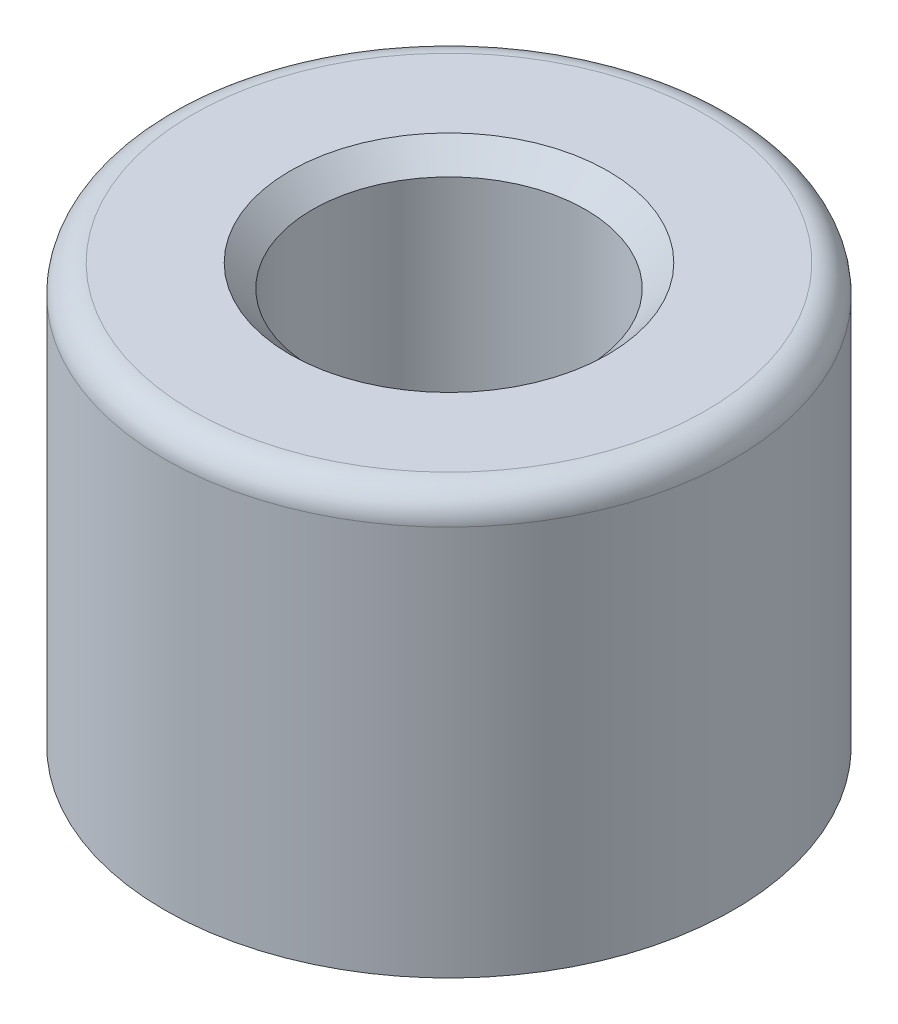
ISO-10303-21;
HEADER;
FILE_DESCRIPTION(('STEP AP214'),'2;1');
FILE_NAME('part.step','',(''),(''),'','','');
FILE_SCHEMA(('AUTOMOTIVE_DESIGN { 1 0 10303 214 1 1 1 1 }'));
ENDSEC;
DATA;
#1=APPLICATION_CONTEXT('core data for automotive mechanical design processes');
#2=APPLICATION_PROTOCOL_DEFINITION('international standard','automotive_design',2000,#1);
#3=PRODUCT_CONTEXT('',#1,'mechanical');
#4=PRODUCT('Part','Part','',(#3));
#5=PRODUCT_RELATED_PRODUCT_CATEGORY('part','',(#4));
#6=PRODUCT_DEFINITION_FORMATION('','',#4);
#7=PRODUCT_DEFINITION_CONTEXT('part definition',#1,'design');
#8=PRODUCT_DEFINITION('design','',#6,#7);
#9=PRODUCT_DEFINITION_SHAPE('','',#8);
#10=(LENGTH_UNIT() NAMED_UNIT(*) SI_UNIT(.MILLI.,.METRE.));
#11=(NAMED_UNIT(*) PLANE_ANGLE_UNIT() SI_UNIT($,.RADIAN.));
#12=(NAMED_UNIT(*) SI_UNIT($,.STERADIAN.) SOLID_ANGLE_UNIT());
#13=UNCERTAINTY_MEASURE_WITH_UNIT(LENGTH_MEASURE(1.E-05),#10,'distance_accuracy_value','');
#14=(GEOMETRIC_REPRESENTATION_CONTEXT(3) GLOBAL_UNCERTAINTY_ASSIGNED_CONTEXT((#13)) GLOBAL_UNIT_ASSIGNED_CONTEXT((#10,
#11,#12)) REPRESENTATION_CONTEXT('',''));
#15=CARTESIAN_POINT('',(0.,0.,0.));
#16=DIRECTION('',(0.,0.,1.));
#17=DIRECTION('',(1.,0.,0.));
#18=AXIS2_PLACEMENT_3D('',#15,#16,#17);
#19=CARTESIAN_POINT('',(0.,9.525,0.));
#20=DIRECTION('',(0.,-1.,0.));
#21=DIRECTION('',(0.,0.,-1.));
#22=AXIS2_PLACEMENT_3D('',#19,#20,#21);
#23=CYLINDRICAL_SURFACE('',#22,6.477);
#24=CARTESIAN_POINT('',(0.,8.89,0.));
#25=DIRECTION('',(0.,1.,0.));
#26=DIRECTION('',(0.,0.,1.));
#27=AXIS2_PLACEMENT_3D('',#24,#25,#26);
#28=CIRCLE('',#27,6.477);
#29=CARTESIAN_POINT('',(0.,8.89,6.477));
#30=VERTEX_POINT('',#29);
#31=EDGE_CURVE('E47',#30,#30,#28,.F.);
#32=ORIENTED_EDGE('',*,*,#31,.T.);
#33=EDGE_LOOP('',(#32));
#34=FACE_BOUND('',#33,.T.);
#35=CARTESIAN_POINT('',(0.,0.,0.));
#36=DIRECTION('',(0.,1.,0.));
#37=DIRECTION('',(0.,0.,1.));
#38=AXIS2_PLACEMENT_3D('',#35,#36,#37);
#39=CIRCLE('',#38,6.477);
#40=CARTESIAN_POINT('',(0.,0.,6.477));
#41=VERTEX_POINT('',#40);
#42=EDGE_CURVE('E56',#41,#41,#39,.T.);
#43=ORIENTED_EDGE('',*,*,#42,.T.);
#44=EDGE_LOOP('',(#43));
#45=FACE_BOUND('',#44,.T.);
#46=ADVANCED_FACE('F35',(#34,#45),#23,.T.);
#47=CARTESIAN_POINT('',(0.,9.525,0.));
#48=DIRECTION('',(0.,1.,0.));
#49=DIRECTION('',(0.,0.,1.));
#50=AXIS2_PLACEMENT_3D('',#47,#48,#49);
#51=PLANE('',#50);
#52=CARTESIAN_POINT('',(0.,9.525,0.));
#53=DIRECTION('',(0.,1.,0.));
#54=DIRECTION('',(0.,0.,1.));
#55=AXIS2_PLACEMENT_3D('',#52,#53,#54);
#56=CIRCLE('',#55,3.6195);
#57=CARTESIAN_POINT('',(0.,9.525,3.6195));
#58=VERTEX_POINT('',#57);
#59=EDGE_CURVE('E10',#58,#58,#56,.F.);
#60=ORIENTED_EDGE('',*,*,#59,.T.);
#61=EDGE_LOOP('',(#60));
#62=FACE_BOUND('',#61,.T.);
#63=CARTESIAN_POINT('',(0.,9.525,0.));
#64=DIRECTION('',(0.,1.,0.));
#65=DIRECTION('',(0.,0.,1.));
#66=AXIS2_PLACEMENT_3D('',#63,#64,#65);
#67=CIRCLE('',#66,5.842);
#68=CARTESIAN_POINT('',(0.,9.525,5.842));
#69=VERTEX_POINT('',#68);
#70=EDGE_CURVE('E51',#69,#69,#67,.T.);
#71=ORIENTED_EDGE('',*,*,#70,.T.);
#72=EDGE_LOOP('',(#71));
#73=FACE_BOUND('',#72,.T.);
#74=ADVANCED_FACE('F69',(#62,#73),#51,.T.);
#75=CARTESIAN_POINT('',(0.,0.,0.));
#76=DIRECTION('',(0.,1.,0.));
#77=DIRECTION('',(0.,0.,1.));
#78=AXIS2_PLACEMENT_3D('',#75,#76,#77);
#79=PLANE('',#78);
#80=CARTESIAN_POINT('',(0.,0.,0.));
#81=DIRECTION('',(0.,1.,0.));
#82=DIRECTION('',(0.,0.,1.));
#83=AXIS2_PLACEMENT_3D('',#80,#81,#82);
#84=CIRCLE('',#83,3.1115);
#85=CARTESIAN_POINT('',(0.,0.,3.1115));
#86=VERTEX_POINT('',#85);
#87=EDGE_CURVE('E59',#86,#86,#84,.F.);
#88=ORIENTED_EDGE('',*,*,#87,.F.);
#89=EDGE_LOOP('',(#88));
#90=FACE_BOUND('',#89,.T.);
#91=ORIENTED_EDGE('',*,*,#42,.F.);
#92=EDGE_LOOP('',(#91));
#93=FACE_BOUND('',#92,.T.);
#94=ADVANCED_FACE('F65',(#90,#93),#79,.F.);
#95=CARTESIAN_POINT('',(0.,8.89,0.));
#96=DIRECTION('',(0.,1.,0.));
#97=DIRECTION('',(0.,0.,1.));
#98=AXIS2_PLACEMENT_3D('',#95,#96,#97);
#99=TOROIDAL_SURFACE('',#98,5.842,0.635);
#100=ORIENTED_EDGE('',*,*,#31,.F.);
#101=EDGE_LOOP('',(#100));
#102=FACE_BOUND('',#101,.T.);
#103=ORIENTED_EDGE('',*,*,#70,.F.);
#104=EDGE_LOOP('',(#103));
#105=FACE_BOUND('',#104,.T.);
#106=ADVANCED_FACE('F68',(#102,#105),#99,.T.);
#107=CARTESIAN_POINT('',(0.,9.525,0.));
#108=DIRECTION('',(0.,1.,0.));
#109=DIRECTION('',(0.,0.,1.));
#110=AXIS2_PLACEMENT_3D('',#107,#108,#109);
#111=CYLINDRICAL_SURFACE('',#110,3.1115);
#112=CARTESIAN_POINT('',(0.,9.017,0.));
#113=DIRECTION('',(0.,1.,0.));
#114=DIRECTION('',(0.,0.,1.));
#115=AXIS2_PLACEMENT_3D('',#112,#113,#114);
#116=CIRCLE('',#115,3.1115);
#117=CARTESIAN_POINT('',(0.,9.017,3.1115));
#118=VERTEX_POINT('',#117);
#119=EDGE_CURVE('E43',#118,#118,#116,.T.);
#120=ORIENTED_EDGE('',*,*,#119,.T.);
#121=EDGE_LOOP('',(#120));
#122=FACE_BOUND('',#121,.T.);
#123=ORIENTED_EDGE('',*,*,#87,.T.);
#124=EDGE_LOOP('',(#123));
#125=FACE_BOUND('',#124,.T.);
#126=ADVANCED_FACE('F63',(#122,#125),#111,.F.);
#127=CARTESIAN_POINT('',(0.,9.017,0.));
#128=DIRECTION('',(0.,1.,0.));
#129=DIRECTION('',(0.,0.,1.));
#130=AXIS2_PLACEMENT_3D('',#127,#128,#129);
#131=CONICAL_SURFACE('',#130,3.1115,0.78539816339745);
#132=ORIENTED_EDGE('',*,*,#59,.F.);
#133=EDGE_LOOP('',(#132));
#134=FACE_BOUND('',#133,.T.);
#135=ORIENTED_EDGE('',*,*,#119,.F.);
#136=EDGE_LOOP('',(#135));
#137=FACE_BOUND('',#136,.T.);
#138=ADVANCED_FACE('F38',(#134,#137),#131,.F.);
#139=CLOSED_SHELL('',(#46,#74,#94,#106,#126,#138));
#140=MANIFOLD_SOLID_BREP('B2',#139);
#141=ADVANCED_BREP_SHAPE_REPRESENTATION('',(#18,#140),#14);
#142=SHAPE_DEFINITION_REPRESENTATION(#9,#141);
ENDSEC;
END-ISO-10303-21;
